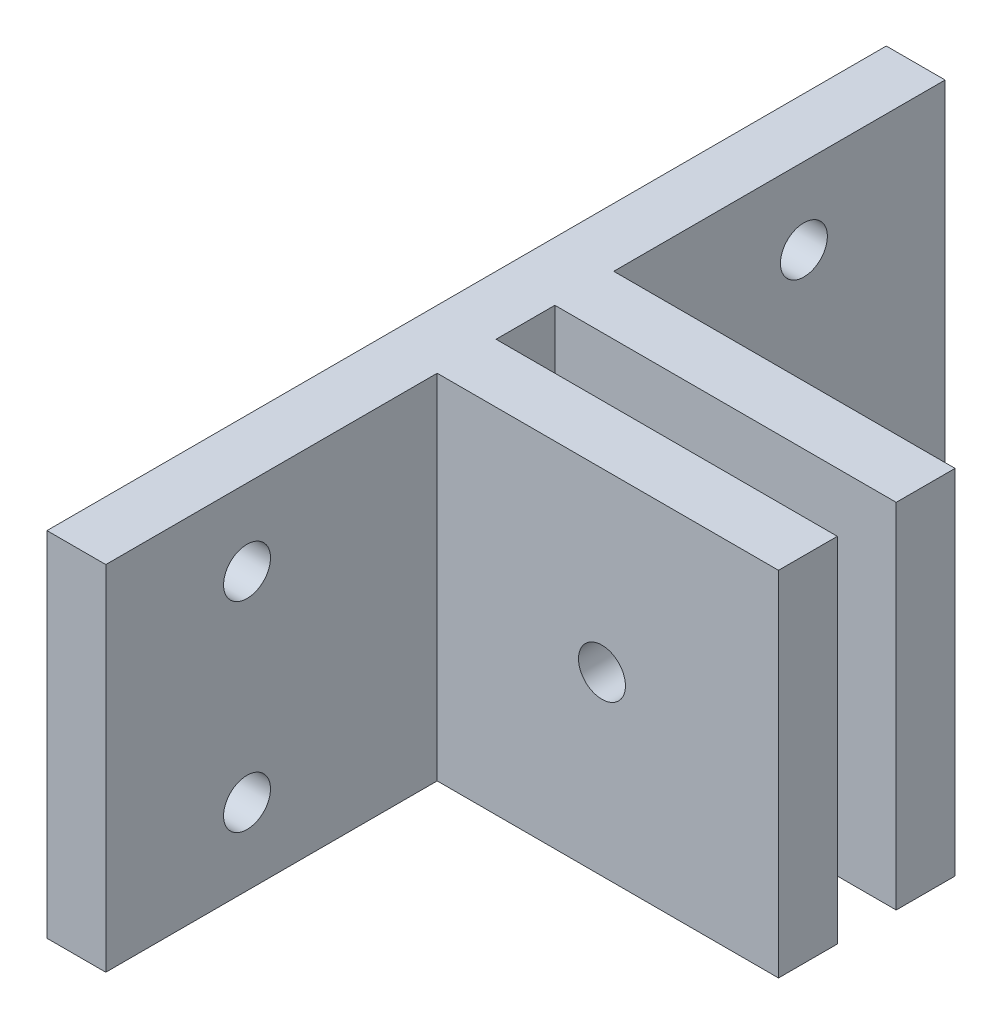
ISO-10303-21;
HEADER;
FILE_DESCRIPTION(('STEP AP214'),'2;1');
FILE_NAME('part.step','',(''),(''),'','','');
FILE_SCHEMA(('AUTOMOTIVE_DESIGN { 1 0 10303 214 1 1 1 1 }'));
ENDSEC;
DATA;
#1=APPLICATION_CONTEXT('core data for automotive mechanical design processes');
#2=APPLICATION_PROTOCOL_DEFINITION('international standard','automotive_design',2000,#1);
#3=PRODUCT_CONTEXT('',#1,'mechanical');
#4=PRODUCT('Part','Part','',(#3));
#5=PRODUCT_RELATED_PRODUCT_CATEGORY('part','',(#4));
#6=PRODUCT_DEFINITION_FORMATION('','',#4);
#7=PRODUCT_DEFINITION_CONTEXT('part definition',#1,'design');
#8=PRODUCT_DEFINITION('design','',#6,#7);
#9=PRODUCT_DEFINITION_SHAPE('','',#8);
#10=(LENGTH_UNIT() NAMED_UNIT(*) SI_UNIT(.MILLI.,.METRE.));
#11=(NAMED_UNIT(*) PLANE_ANGLE_UNIT() SI_UNIT($,.RADIAN.));
#12=(NAMED_UNIT(*) SI_UNIT($,.STERADIAN.) SOLID_ANGLE_UNIT());
#13=UNCERTAINTY_MEASURE_WITH_UNIT(LENGTH_MEASURE(1.E-05),#10,'distance_accuracy_value','');
#14=(GEOMETRIC_REPRESENTATION_CONTEXT(3) GLOBAL_UNCERTAINTY_ASSIGNED_CONTEXT((#13)) GLOBAL_UNIT_ASSIGNED_CONTEXT((#10,
#11,#12)) REPRESENTATION_CONTEXT('',''));
#15=CARTESIAN_POINT('',(0.,0.,0.));
#16=DIRECTION('',(0.,0.,1.));
#17=DIRECTION('',(1.,0.,0.));
#18=AXIS2_PLACEMENT_3D('',#15,#16,#17);
#19=CARTESIAN_POINT('',(0.,19.05,-22.6419411646515));
#20=DIRECTION('',(0.,0.,1.));
#21=DIRECTION('',(1.,0.,0.));
#22=AXIS2_PLACEMENT_3D('',#19,#20,#21);
#23=PLANE('',#22);
#24=DIRECTION('',(-1.,0.,0.));
#25=VECTOR('',#24,1.);
#26=CARTESIAN_POINT('',(0.,0.,-22.6419411646515));
#27=LINE('',#26,#25);
#28=CARTESIAN_POINT('',(3.175,0.,-22.6419411646515));
#29=VERTEX_POINT('',#28);
#30=CARTESIAN_POINT('',(0.,0.,-22.6419411646515));
#31=VERTEX_POINT('',#30);
#32=EDGE_CURVE('E156',#29,#31,#27,.T.);
#33=ORIENTED_EDGE('',*,*,#32,.T.);
#34=DIRECTION('',(0.,-1.,0.));
#35=VECTOR('',#34,1.);
#36=CARTESIAN_POINT('',(0.,19.05,-22.6419411646515));
#37=LINE('',#36,#35);
#38=CARTESIAN_POINT('',(0.,19.05,-22.6419411646515));
#39=VERTEX_POINT('',#38);
#40=EDGE_CURVE('E11',#39,#31,#37,.T.);
#41=ORIENTED_EDGE('',*,*,#40,.F.);
#42=DIRECTION('',(-1.,0.,0.));
#43=VECTOR('',#42,1.);
#44=CARTESIAN_POINT('',(0.,19.05,-22.6419411646515));
#45=LINE('',#44,#43);
#46=CARTESIAN_POINT('',(3.175,19.05,-22.6419411646515));
#47=VERTEX_POINT('',#46);
#48=EDGE_CURVE('E179',#47,#39,#45,.T.);
#49=ORIENTED_EDGE('',*,*,#48,.F.);
#50=DIRECTION('',(0.,-1.,0.));
#51=VECTOR('',#50,1.);
#52=CARTESIAN_POINT('',(3.175,19.05,-22.6419411646515));
#53=LINE('',#52,#51);
#54=EDGE_CURVE('E152',#47,#29,#53,.T.);
#55=ORIENTED_EDGE('',*,*,#54,.T.);
#56=EDGE_LOOP('',(#33,#41,#49,#55));
#57=FACE_BOUND('',#56,.T.);
#58=ADVANCED_FACE('F35',(#57),#23,.F.);
#59=CARTESIAN_POINT('',(0.,19.05,22.6419411646515));
#60=DIRECTION('',(1.,0.,0.));
#61=DIRECTION('',(0.,0.,-1.));
#62=AXIS2_PLACEMENT_3D('',#59,#60,#61);
#63=PLANE('',#62);
#64=CARTESIAN_POINT('',(0.,14.9225,-15.0219411646515));
#65=DIRECTION('',(1.,0.,0.));
#66=DIRECTION('',(0.,0.,1.));
#67=AXIS2_PLACEMENT_3D('',#64,#65,#66);
#68=CIRCLE('',#67,1.26619);
#69=CARTESIAN_POINT('',(0.,14.9225,-13.7557511646515));
#70=VERTEX_POINT('',#69);
#71=EDGE_CURVE('E449',#70,#70,#68,.T.);
#72=ORIENTED_EDGE('',*,*,#71,.T.);
#73=EDGE_LOOP('',(#72));
#74=FACE_BOUND('',#73,.T.);
#75=CARTESIAN_POINT('',(0.,4.1275,-15.0219411646515));
#76=DIRECTION('',(1.,0.,0.));
#77=DIRECTION('',(0.,0.,-1.));
#78=AXIS2_PLACEMENT_3D('',#75,#76,#77);
#79=CIRCLE('',#78,1.26619);
#80=CARTESIAN_POINT('',(0.,4.1275,-16.2881311646515));
#81=VERTEX_POINT('',#80);
#82=EDGE_CURVE('E439',#81,#81,#79,.T.);
#83=ORIENTED_EDGE('',*,*,#82,.T.);
#84=EDGE_LOOP('',(#83));
#85=FACE_BOUND('',#84,.T.);
#86=CARTESIAN_POINT('',(0.,4.1275,15.0219411646515));
#87=DIRECTION('',(1.,0.,0.));
#88=DIRECTION('',(0.,0.,1.));
#89=AXIS2_PLACEMENT_3D('',#86,#87,#88);
#90=CIRCLE('',#89,1.26619);
#91=CARTESIAN_POINT('',(0.,4.1275,16.2881311646515));
#92=VERTEX_POINT('',#91);
#93=EDGE_CURVE('E435',#92,#92,#90,.T.);
#94=ORIENTED_EDGE('',*,*,#93,.T.);
#95=EDGE_LOOP('',(#94));
#96=FACE_BOUND('',#95,.T.);
#97=CARTESIAN_POINT('',(0.,14.9225,15.0219411646515));
#98=DIRECTION('',(1.,0.,0.));
#99=DIRECTION('',(0.,0.,-1.));
#100=AXIS2_PLACEMENT_3D('',#97,#98,#99);
#101=CIRCLE('',#100,1.26619);
#102=CARTESIAN_POINT('',(0.,14.9225,13.7557511646515));
#103=VERTEX_POINT('',#102);
#104=EDGE_CURVE('E454',#103,#103,#101,.T.);
#105=ORIENTED_EDGE('',*,*,#104,.T.);
#106=EDGE_LOOP('',(#105));
#107=FACE_BOUND('',#106,.T.);
#108=DIRECTION('',(0.,0.,1.));
#109=VECTOR('',#108,1.);
#110=CARTESIAN_POINT('',(0.,0.,22.6419411646515));
#111=LINE('',#110,#109);
#112=CARTESIAN_POINT('',(0.,0.,22.6419411646515));
#113=VERTEX_POINT('',#112);
#114=EDGE_CURVE('E159',#31,#113,#111,.T.);
#115=ORIENTED_EDGE('',*,*,#114,.T.);
#116=DIRECTION('',(0.,-1.,0.));
#117=VECTOR('',#116,1.);
#118=CARTESIAN_POINT('',(0.,19.05,22.6419411646515));
#119=LINE('',#118,#117);
#120=CARTESIAN_POINT('',(0.,19.05,22.6419411646515));
#121=VERTEX_POINT('',#120);
#122=EDGE_CURVE('E44',#121,#113,#119,.T.);
#123=ORIENTED_EDGE('',*,*,#122,.F.);
#124=DIRECTION('',(0.,0.,1.));
#125=VECTOR('',#124,1.);
#126=CARTESIAN_POINT('',(0.,19.05,22.6419411646515));
#127=LINE('',#126,#125);
#128=EDGE_CURVE('E107',#39,#121,#127,.T.);
#129=ORIENTED_EDGE('',*,*,#128,.F.);
#130=ORIENTED_EDGE('',*,*,#40,.T.);
#131=EDGE_LOOP('',(#115,#123,#129,#130));
#132=FACE_BOUND('',#131,.T.);
#133=ADVANCED_FACE('F262',(#74,#85,#96,#107,#132),#63,.F.);
#134=CARTESIAN_POINT('',(0.,19.05,22.6419411646515));
#135=DIRECTION('',(0.,0.,-1.));
#136=DIRECTION('',(-1.,0.,0.));
#137=AXIS2_PLACEMENT_3D('',#134,#135,#136);
#138=PLANE('',#137);
#139=DIRECTION('',(1.,0.,0.));
#140=VECTOR('',#139,1.);
#141=CARTESIAN_POINT('',(0.,0.,22.6419411646515));
#142=LINE('',#141,#140);
#143=CARTESIAN_POINT('',(3.175,0.,22.6419411646515));
#144=VERTEX_POINT('',#143);
#145=EDGE_CURVE('E162',#113,#144,#142,.T.);
#146=ORIENTED_EDGE('',*,*,#145,.T.);
#147=DIRECTION('',(0.,-1.,0.));
#148=VECTOR('',#147,1.);
#149=CARTESIAN_POINT('',(3.175,19.05,22.6419411646515));
#150=LINE('',#149,#148);
#151=CARTESIAN_POINT('',(3.175,19.05,22.6419411646515));
#152=VERTEX_POINT('',#151);
#153=EDGE_CURVE('E198',#152,#144,#150,.T.);
#154=ORIENTED_EDGE('',*,*,#153,.F.);
#155=DIRECTION('',(1.,0.,0.));
#156=VECTOR('',#155,1.);
#157=CARTESIAN_POINT('',(0.,19.05,22.6419411646515));
#158=LINE('',#157,#156);
#159=EDGE_CURVE('E207',#121,#152,#158,.T.);
#160=ORIENTED_EDGE('',*,*,#159,.F.);
#161=ORIENTED_EDGE('',*,*,#122,.T.);
#162=EDGE_LOOP('',(#146,#154,#160,#161));
#163=FACE_BOUND('',#162,.T.);
#164=ADVANCED_FACE('F205',(#163),#138,.F.);
#165=CARTESIAN_POINT('',(3.175,19.05,22.6419411646515));
#166=DIRECTION('',(-1.,0.,0.));
#167=DIRECTION('',(0.,0.,1.));
#168=AXIS2_PLACEMENT_3D('',#165,#166,#167);
#169=PLANE('',#168);
#170=CARTESIAN_POINT('',(3.175,4.1275,15.0219411646515));
#171=DIRECTION('',(1.,0.,0.));
#172=DIRECTION('',(0.,0.,1.));
#173=AXIS2_PLACEMENT_3D('',#170,#171,#172);
#174=CIRCLE('',#173,1.26619);
#175=CARTESIAN_POINT('',(3.175,4.1275,16.2881311646515));
#176=VERTEX_POINT('',#175);
#177=EDGE_CURVE('E438',#176,#176,#174,.T.);
#178=ORIENTED_EDGE('',*,*,#177,.F.);
#179=EDGE_LOOP('',(#178));
#180=FACE_BOUND('',#179,.T.);
#181=CARTESIAN_POINT('',(3.175,14.9225,15.0219411646515));
#182=DIRECTION('',(1.,0.,0.));
#183=DIRECTION('',(0.,0.,-1.));
#184=AXIS2_PLACEMENT_3D('',#181,#182,#183);
#185=CIRCLE('',#184,1.26619);
#186=CARTESIAN_POINT('',(3.175,14.9225,13.7557511646515));
#187=VERTEX_POINT('',#186);
#188=EDGE_CURVE('E441',#187,#187,#185,.T.);
#189=ORIENTED_EDGE('',*,*,#188,.F.);
#190=EDGE_LOOP('',(#189));
#191=FACE_BOUND('',#190,.T.);
#192=DIRECTION('',(0.,0.,-1.));
#193=VECTOR('',#192,1.);
#194=CARTESIAN_POINT('',(3.175,0.,22.6419411646515));
#195=LINE('',#194,#193);
#196=CARTESIAN_POINT('',(3.175,0.,4.7625));
#197=VERTEX_POINT('',#196);
#198=EDGE_CURVE('E164',#144,#197,#195,.T.);
#199=ORIENTED_EDGE('',*,*,#198,.T.);
#200=DIRECTION('',(0.,-1.,0.));
#201=VECTOR('',#200,1.);
#202=CARTESIAN_POINT('',(3.175,19.05,4.7625));
#203=LINE('',#202,#201);
#204=CARTESIAN_POINT('',(3.175,19.05,4.7625));
#205=VERTEX_POINT('',#204);
#206=EDGE_CURVE('E195',#205,#197,#203,.T.);
#207=ORIENTED_EDGE('',*,*,#206,.F.);
#208=DIRECTION('',(0.,0.,-1.));
#209=VECTOR('',#208,1.);
#210=CARTESIAN_POINT('',(3.175,19.05,22.6419411646515));
#211=LINE('',#210,#209);
#212=EDGE_CURVE('E225',#152,#205,#211,.T.);
#213=ORIENTED_EDGE('',*,*,#212,.F.);
#214=ORIENTED_EDGE('',*,*,#153,.T.);
#215=EDGE_LOOP('',(#199,#207,#213,#214));
#216=FACE_BOUND('',#215,.T.);
#217=ADVANCED_FACE('F216',(#180,#191,#216),#169,.F.);
#218=CARTESIAN_POINT('',(3.175,19.05,4.7625));
#219=DIRECTION('',(0.,0.,-1.));
#220=DIRECTION('',(-1.,0.,0.));
#221=AXIS2_PLACEMENT_3D('',#218,#219,#220);
#222=PLANE('',#221);
#223=CARTESIAN_POINT('',(12.065,9.525,4.7625));
#224=DIRECTION('',(0.,0.,-1.));
#225=DIRECTION('',(-1.,0.,0.));
#226=AXIS2_PLACEMENT_3D('',#223,#224,#225);
#227=CIRCLE('',#226,1.26619);
#228=CARTESIAN_POINT('',(10.79881,9.525,4.7625));
#229=VERTEX_POINT('',#228);
#230=EDGE_CURVE('E160',#229,#229,#227,.T.);
#231=ORIENTED_EDGE('',*,*,#230,.T.);
#232=EDGE_LOOP('',(#231));
#233=FACE_BOUND('',#232,.T.);
#234=DIRECTION('',(1.,0.,0.));
#235=VECTOR('',#234,1.);
#236=CARTESIAN_POINT('',(3.175,0.,4.7625));
#237=LINE('',#236,#235);
#238=CARTESIAN_POINT('',(21.59,0.,4.7625));
#239=VERTEX_POINT('',#238);
#240=EDGE_CURVE('E166',#197,#239,#237,.T.);
#241=ORIENTED_EDGE('',*,*,#240,.T.);
#242=DIRECTION('',(0.,-1.,0.));
#243=VECTOR('',#242,1.);
#244=CARTESIAN_POINT('',(21.59,19.05,4.7625));
#245=LINE('',#244,#243);
#246=CARTESIAN_POINT('',(21.59,19.05,4.7625));
#247=VERTEX_POINT('',#246);
#248=EDGE_CURVE('E192',#247,#239,#245,.T.);
#249=ORIENTED_EDGE('',*,*,#248,.F.);
#250=DIRECTION('',(1.,0.,0.));
#251=VECTOR('',#250,1.);
#252=CARTESIAN_POINT('',(3.175,19.05,4.7625));
#253=LINE('',#252,#251);
#254=EDGE_CURVE('E222',#205,#247,#253,.T.);
#255=ORIENTED_EDGE('',*,*,#254,.F.);
#256=ORIENTED_EDGE('',*,*,#206,.T.);
#257=EDGE_LOOP('',(#241,#249,#255,#256));
#258=FACE_BOUND('',#257,.T.);
#259=ADVANCED_FACE('F220',(#233,#258),#222,.F.);
#260=CARTESIAN_POINT('',(21.59,19.05,4.7625));
#261=DIRECTION('',(-1.,0.,0.));
#262=DIRECTION('',(0.,0.,1.));
#263=AXIS2_PLACEMENT_3D('',#260,#261,#262);
#264=PLANE('',#263);
#265=DIRECTION('',(0.,0.,-1.));
#266=VECTOR('',#265,1.);
#267=CARTESIAN_POINT('',(21.59,0.,4.7625));
#268=LINE('',#267,#266);
#269=CARTESIAN_POINT('',(21.59,0.,1.5875));
#270=VERTEX_POINT('',#269);
#271=EDGE_CURVE('E168',#239,#270,#268,.T.);
#272=ORIENTED_EDGE('',*,*,#271,.T.);
#273=DIRECTION('',(0.,-1.,0.));
#274=VECTOR('',#273,1.);
#275=CARTESIAN_POINT('',(21.59,19.05,1.5875));
#276=LINE('',#275,#274);
#277=CARTESIAN_POINT('',(21.59,19.05,1.5875));
#278=VERTEX_POINT('',#277);
#279=EDGE_CURVE('E189',#278,#270,#276,.T.);
#280=ORIENTED_EDGE('',*,*,#279,.F.);
#281=DIRECTION('',(0.,0.,-1.));
#282=VECTOR('',#281,1.);
#283=CARTESIAN_POINT('',(21.59,19.05,4.7625));
#284=LINE('',#283,#282);
#285=EDGE_CURVE('E224',#247,#278,#284,.T.);
#286=ORIENTED_EDGE('',*,*,#285,.F.);
#287=ORIENTED_EDGE('',*,*,#248,.T.);
#288=EDGE_LOOP('',(#272,#280,#286,#287));
#289=FACE_BOUND('',#288,.T.);
#290=ADVANCED_FACE('F279',(#289),#264,.F.);
#291=CARTESIAN_POINT('',(21.59,19.05,1.5875));
#292=DIRECTION('',(0.,0.,1.));
#293=DIRECTION('',(1.,0.,0.));
#294=AXIS2_PLACEMENT_3D('',#291,#292,#293);
#295=PLANE('',#294);
#296=CARTESIAN_POINT('',(12.065,9.525,1.5875));
#297=DIRECTION('',(0.,0.,1.));
#298=DIRECTION('',(1.,0.,0.));
#299=AXIS2_PLACEMENT_3D('',#296,#297,#298);
#300=CIRCLE('',#299,1.26619);
#301=CARTESIAN_POINT('',(13.33119,9.525,1.5875));
#302=VERTEX_POINT('',#301);
#303=EDGE_CURVE('E462',#302,#302,#300,.T.);
#304=ORIENTED_EDGE('',*,*,#303,.T.);
#305=EDGE_LOOP('',(#304));
#306=FACE_BOUND('',#305,.T.);
#307=DIRECTION('',(-1.,0.,0.));
#308=VECTOR('',#307,1.);
#309=CARTESIAN_POINT('',(21.59,0.,1.5875));
#310=LINE('',#309,#308);
#311=CARTESIAN_POINT('',(3.175,0.,1.5875));
#312=VERTEX_POINT('',#311);
#313=EDGE_CURVE('E170',#270,#312,#310,.T.);
#314=ORIENTED_EDGE('',*,*,#313,.T.);
#315=DIRECTION('',(0.,-1.,0.));
#316=VECTOR('',#315,1.);
#317=CARTESIAN_POINT('',(3.175,19.05,1.5875));
#318=LINE('',#317,#316);
#319=CARTESIAN_POINT('',(3.175,19.05,1.5875));
#320=VERTEX_POINT('',#319);
#321=EDGE_CURVE('E186',#320,#312,#318,.T.);
#322=ORIENTED_EDGE('',*,*,#321,.F.);
#323=DIRECTION('',(-1.,0.,0.));
#324=VECTOR('',#323,1.);
#325=CARTESIAN_POINT('',(21.59,19.05,1.5875));
#326=LINE('',#325,#324);
#327=EDGE_CURVE('E227',#278,#320,#326,.T.);
#328=ORIENTED_EDGE('',*,*,#327,.F.);
#329=ORIENTED_EDGE('',*,*,#279,.T.);
#330=EDGE_LOOP('',(#314,#322,#328,#329));
#331=FACE_BOUND('',#330,.T.);
#332=ADVANCED_FACE('F283',(#306,#331),#295,.F.);
#333=CARTESIAN_POINT('',(3.175,19.05,-1.5875));
#334=DIRECTION('',(-1.,0.,0.));
#335=DIRECTION('',(0.,0.,1.));
#336=AXIS2_PLACEMENT_3D('',#333,#334,#335);
#337=PLANE('',#336);
#338=DIRECTION('',(0.,0.,-1.));
#339=VECTOR('',#338,1.);
#340=CARTESIAN_POINT('',(3.175,0.,-1.5875));
#341=LINE('',#340,#339);
#342=CARTESIAN_POINT('',(3.175,0.,-1.5875));
#343=VERTEX_POINT('',#342);
#344=EDGE_CURVE('E172',#312,#343,#341,.T.);
#345=ORIENTED_EDGE('',*,*,#344,.T.);
#346=DIRECTION('',(0.,-1.,0.));
#347=VECTOR('',#346,1.);
#348=CARTESIAN_POINT('',(3.175,19.05,-1.5875));
#349=LINE('',#348,#347);
#350=CARTESIAN_POINT('',(3.175,19.05,-1.5875));
#351=VERTEX_POINT('',#350);
#352=EDGE_CURVE('E183',#351,#343,#349,.T.);
#353=ORIENTED_EDGE('',*,*,#352,.F.);
#354=DIRECTION('',(0.,0.,-1.));
#355=VECTOR('',#354,1.);
#356=CARTESIAN_POINT('',(3.175,19.05,-1.5875));
#357=LINE('',#356,#355);
#358=EDGE_CURVE('E233',#320,#351,#357,.T.);
#359=ORIENTED_EDGE('',*,*,#358,.F.);
#360=ORIENTED_EDGE('',*,*,#321,.T.);
#361=EDGE_LOOP('',(#345,#353,#359,#360));
#362=FACE_BOUND('',#361,.T.);
#363=ADVANCED_FACE('F239',(#362),#337,.F.);
#364=CARTESIAN_POINT('',(21.59,19.05,-1.5875));
#365=DIRECTION('',(0.,0.,-1.));
#366=DIRECTION('',(-1.,0.,0.));
#367=AXIS2_PLACEMENT_3D('',#364,#365,#366);
#368=PLANE('',#367);
#369=CARTESIAN_POINT('',(12.065,9.525,-1.5875));
#370=DIRECTION('',(0.,0.,-1.));
#371=DIRECTION('',(-1.,0.,0.));
#372=AXIS2_PLACEMENT_3D('',#369,#370,#371);
#373=CIRCLE('',#372,1.26619);
#374=CARTESIAN_POINT('',(10.79881,9.525,-1.5875));
#375=VERTEX_POINT('',#374);
#376=EDGE_CURVE('E459',#375,#375,#373,.T.);
#377=ORIENTED_EDGE('',*,*,#376,.T.);
#378=EDGE_LOOP('',(#377));
#379=FACE_BOUND('',#378,.T.);
#380=DIRECTION('',(1.,0.,0.));
#381=VECTOR('',#380,1.);
#382=CARTESIAN_POINT('',(21.59,0.,-1.5875));
#383=LINE('',#382,#381);
#384=CARTESIAN_POINT('',(21.59,0.,-1.5875));
#385=VERTEX_POINT('',#384);
#386=EDGE_CURVE('E174',#343,#385,#383,.T.);
#387=ORIENTED_EDGE('',*,*,#386,.T.);
#388=DIRECTION('',(0.,-1.,0.));
#389=VECTOR('',#388,1.);
#390=CARTESIAN_POINT('',(21.59,19.05,-1.5875));
#391=LINE('',#390,#389);
#392=CARTESIAN_POINT('',(21.59,19.05,-1.5875));
#393=VERTEX_POINT('',#392);
#394=EDGE_CURVE('E147',#393,#385,#391,.T.);
#395=ORIENTED_EDGE('',*,*,#394,.F.);
#396=DIRECTION('',(1.,0.,0.));
#397=VECTOR('',#396,1.);
#398=CARTESIAN_POINT('',(21.59,19.05,-1.5875));
#399=LINE('',#398,#397);
#400=EDGE_CURVE('E138',#351,#393,#399,.T.);
#401=ORIENTED_EDGE('',*,*,#400,.F.);
#402=ORIENTED_EDGE('',*,*,#352,.T.);
#403=EDGE_LOOP('',(#387,#395,#401,#402));
#404=FACE_BOUND('',#403,.T.);
#405=ADVANCED_FACE('F243',(#379,#404),#368,.F.);
#406=CARTESIAN_POINT('',(21.59,19.05,-4.7625));
#407=DIRECTION('',(-1.,0.,0.));
#408=DIRECTION('',(0.,0.,1.));
#409=AXIS2_PLACEMENT_3D('',#406,#407,#408);
#410=PLANE('',#409);
#411=DIRECTION('',(0.,0.,-1.));
#412=VECTOR('',#411,1.);
#413=CARTESIAN_POINT('',(21.59,0.,-4.7625));
#414=LINE('',#413,#412);
#415=CARTESIAN_POINT('',(21.59,0.,-4.7625));
#416=VERTEX_POINT('',#415);
#417=EDGE_CURVE('E146',#385,#416,#414,.T.);
#418=ORIENTED_EDGE('',*,*,#417,.T.);
#419=DIRECTION('',(0.,-1.,0.));
#420=VECTOR('',#419,1.);
#421=CARTESIAN_POINT('',(21.59,19.05,-4.7625));
#422=LINE('',#421,#420);
#423=CARTESIAN_POINT('',(21.59,19.05,-4.7625));
#424=VERTEX_POINT('',#423);
#425=EDGE_CURVE('E143',#424,#416,#422,.T.);
#426=ORIENTED_EDGE('',*,*,#425,.F.);
#427=DIRECTION('',(0.,0.,-1.));
#428=VECTOR('',#427,1.);
#429=CARTESIAN_POINT('',(21.59,19.05,-4.7625));
#430=LINE('',#429,#428);
#431=EDGE_CURVE('E132',#393,#424,#430,.T.);
#432=ORIENTED_EDGE('',*,*,#431,.F.);
#433=ORIENTED_EDGE('',*,*,#394,.T.);
#434=EDGE_LOOP('',(#418,#426,#432,#433));
#435=FACE_BOUND('',#434,.T.);
#436=ADVANCED_FACE('F144',(#435),#410,.F.);
#437=CARTESIAN_POINT('',(3.175,19.05,-4.7625));
#438=DIRECTION('',(0.,0.,1.));
#439=DIRECTION('',(1.,0.,0.));
#440=AXIS2_PLACEMENT_3D('',#437,#438,#439);
#441=PLANE('',#440);
#442=CARTESIAN_POINT('',(12.065,9.525,-4.7625));
#443=DIRECTION('',(0.,0.,1.));
#444=DIRECTION('',(1.,0.,0.));
#445=AXIS2_PLACEMENT_3D('',#442,#443,#444);
#446=CIRCLE('',#445,1.26619);
#447=CARTESIAN_POINT('',(13.33119,9.525,-4.7625));
#448=VERTEX_POINT('',#447);
#449=EDGE_CURVE('E38',#448,#448,#446,.T.);
#450=ORIENTED_EDGE('',*,*,#449,.T.);
#451=EDGE_LOOP('',(#450));
#452=FACE_BOUND('',#451,.T.);
#453=DIRECTION('',(-1.,0.,0.));
#454=VECTOR('',#453,1.);
#455=CARTESIAN_POINT('',(3.175,0.,-4.7625));
#456=LINE('',#455,#454);
#457=CARTESIAN_POINT('',(3.175,0.,-4.7625));
#458=VERTEX_POINT('',#457);
#459=EDGE_CURVE('E93',#416,#458,#456,.T.);
#460=ORIENTED_EDGE('',*,*,#459,.T.);
#461=DIRECTION('',(0.,-1.,0.));
#462=VECTOR('',#461,1.);
#463=CARTESIAN_POINT('',(3.175,19.05,-4.7625));
#464=LINE('',#463,#462);
#465=CARTESIAN_POINT('',(3.175,19.05,-4.7625));
#466=VERTEX_POINT('',#465);
#467=EDGE_CURVE('E148',#466,#458,#464,.T.);
#468=ORIENTED_EDGE('',*,*,#467,.F.);
#469=DIRECTION('',(-1.,0.,0.));
#470=VECTOR('',#469,1.);
#471=CARTESIAN_POINT('',(3.175,19.05,-4.7625));
#472=LINE('',#471,#470);
#473=EDGE_CURVE('E136',#424,#466,#472,.T.);
#474=ORIENTED_EDGE('',*,*,#473,.F.);
#475=ORIENTED_EDGE('',*,*,#425,.T.);
#476=EDGE_LOOP('',(#460,#468,#474,#475));
#477=FACE_BOUND('',#476,.T.);
#478=ADVANCED_FACE('F150',(#452,#477),#441,.F.);
#479=CARTESIAN_POINT('',(3.175,19.05,-22.6419411646515));
#480=DIRECTION('',(-1.,0.,0.));
#481=DIRECTION('',(0.,0.,1.));
#482=AXIS2_PLACEMENT_3D('',#479,#480,#481);
#483=PLANE('',#482);
#484=CARTESIAN_POINT('',(3.17499999999999,14.9225,-15.0219411646515));
#485=DIRECTION('',(1.,0.,0.));
#486=DIRECTION('',(0.,0.,1.));
#487=AXIS2_PLACEMENT_3D('',#484,#485,#486);
#488=CIRCLE('',#487,1.26619);
#489=CARTESIAN_POINT('',(3.17499999999999,14.9225,-13.7557511646515));
#490=VERTEX_POINT('',#489);
#491=EDGE_CURVE('E451',#490,#490,#488,.T.);
#492=ORIENTED_EDGE('',*,*,#491,.F.);
#493=EDGE_LOOP('',(#492));
#494=FACE_BOUND('',#493,.T.);
#495=CARTESIAN_POINT('',(3.17499999999999,4.1275,-15.0219411646515));
#496=DIRECTION('',(1.,0.,0.));
#497=DIRECTION('',(0.,0.,-1.));
#498=AXIS2_PLACEMENT_3D('',#495,#496,#497);
#499=CIRCLE('',#498,1.26619);
#500=CARTESIAN_POINT('',(3.17499999999999,4.1275,-16.2881311646515));
#501=VERTEX_POINT('',#500);
#502=EDGE_CURVE('E444',#501,#501,#499,.T.);
#503=ORIENTED_EDGE('',*,*,#502,.F.);
#504=EDGE_LOOP('',(#503));
#505=FACE_BOUND('',#504,.T.);
#506=DIRECTION('',(0.,0.,-1.));
#507=VECTOR('',#506,1.);
#508=CARTESIAN_POINT('',(3.175,0.,-22.6419411646515));
#509=LINE('',#508,#507);
#510=EDGE_CURVE('E99',#458,#29,#509,.T.);
#511=ORIENTED_EDGE('',*,*,#510,.T.);
#512=ORIENTED_EDGE('',*,*,#54,.F.);
#513=DIRECTION('',(0.,0.,-1.));
#514=VECTOR('',#513,1.);
#515=CARTESIAN_POINT('',(3.175,19.05,-22.6419411646515));
#516=LINE('',#515,#514);
#517=EDGE_CURVE('E52',#466,#47,#516,.T.);
#518=ORIENTED_EDGE('',*,*,#517,.F.);
#519=ORIENTED_EDGE('',*,*,#467,.T.);
#520=EDGE_LOOP('',(#511,#512,#518,#519));
#521=FACE_BOUND('',#520,.T.);
#522=ADVANCED_FACE('F247',(#494,#505,#521),#483,.F.);
#523=CARTESIAN_POINT('',(0.,19.05,0.));
#524=DIRECTION('',(0.,-1.,0.));
#525=DIRECTION('',(0.,0.,-1.));
#526=AXIS2_PLACEMENT_3D('',#523,#524,#525);
#527=PLANE('',#526);
#528=ORIENTED_EDGE('',*,*,#48,.T.);
#529=ORIENTED_EDGE('',*,*,#128,.T.);
#530=ORIENTED_EDGE('',*,*,#159,.T.);
#531=ORIENTED_EDGE('',*,*,#212,.T.);
#532=ORIENTED_EDGE('',*,*,#254,.T.);
#533=ORIENTED_EDGE('',*,*,#285,.T.);
#534=ORIENTED_EDGE('',*,*,#327,.T.);
#535=ORIENTED_EDGE('',*,*,#358,.T.);
#536=ORIENTED_EDGE('',*,*,#400,.T.);
#537=ORIENTED_EDGE('',*,*,#431,.T.);
#538=ORIENTED_EDGE('',*,*,#473,.T.);
#539=ORIENTED_EDGE('',*,*,#517,.T.);
#540=EDGE_LOOP('',(#528,#529,#530,#531,#532,#533,#534,#535,#536,#537,#538,#539));
#541=FACE_BOUND('',#540,.T.);
#542=ADVANCED_FACE('F134',(#541),#527,.F.);
#543=CARTESIAN_POINT('',(0.,0.,0.));
#544=DIRECTION('',(0.,-1.,0.));
#545=DIRECTION('',(0.,0.,-1.));
#546=AXIS2_PLACEMENT_3D('',#543,#544,#545);
#547=PLANE('',#546);
#548=ORIENTED_EDGE('',*,*,#32,.F.);
#549=ORIENTED_EDGE('',*,*,#510,.F.);
#550=ORIENTED_EDGE('',*,*,#459,.F.);
#551=ORIENTED_EDGE('',*,*,#417,.F.);
#552=ORIENTED_EDGE('',*,*,#386,.F.);
#553=ORIENTED_EDGE('',*,*,#344,.F.);
#554=ORIENTED_EDGE('',*,*,#313,.F.);
#555=ORIENTED_EDGE('',*,*,#271,.F.);
#556=ORIENTED_EDGE('',*,*,#240,.F.);
#557=ORIENTED_EDGE('',*,*,#198,.F.);
#558=ORIENTED_EDGE('',*,*,#145,.F.);
#559=ORIENTED_EDGE('',*,*,#114,.F.);
#560=EDGE_LOOP('',(#548,#549,#550,#551,#552,#553,#554,#555,#556,#557,#558,#559));
#561=FACE_BOUND('',#560,.T.);
#562=ADVANCED_FACE('F211',(#561),#547,.T.);
#563=CARTESIAN_POINT('',(12.065,9.525,-22.6419411646515));
#564=DIRECTION('',(0.,0.,1.));
#565=DIRECTION('',(1.,0.,0.));
#566=AXIS2_PLACEMENT_3D('',#563,#564,#565);
#567=CYLINDRICAL_SURFACE('',#566,1.26619);
#568=ORIENTED_EDGE('',*,*,#449,.F.);
#569=EDGE_LOOP('',(#568));
#570=FACE_BOUND('',#569,.T.);
#571=ORIENTED_EDGE('',*,*,#376,.F.);
#572=EDGE_LOOP('',(#571));
#573=FACE_BOUND('',#572,.T.);
#574=ADVANCED_FACE('F313',(#570,#573),#567,.F.);
#575=ORIENTED_EDGE('',*,*,#303,.F.);
#576=EDGE_LOOP('',(#575));
#577=FACE_BOUND('',#576,.T.);
#578=ORIENTED_EDGE('',*,*,#230,.F.);
#579=EDGE_LOOP('',(#578));
#580=FACE_BOUND('',#579,.T.);
#581=ADVANCED_FACE('F318',(#577,#580),#567,.F.);
#582=CARTESIAN_POINT('',(0.,4.1275,-15.0219411646515));
#583=DIRECTION('',(1.,0.,0.));
#584=DIRECTION('',(0.,0.,-1.));
#585=AXIS2_PLACEMENT_3D('',#582,#583,#584);
#586=CYLINDRICAL_SURFACE('',#585,1.26619);
#587=ORIENTED_EDGE('',*,*,#82,.F.);
#588=EDGE_LOOP('',(#587));
#589=FACE_BOUND('',#588,.T.);
#590=ORIENTED_EDGE('',*,*,#502,.T.);
#591=EDGE_LOOP('',(#590));
#592=FACE_BOUND('',#591,.T.);
#593=ADVANCED_FACE('F329',(#589,#592),#586,.F.);
#594=CARTESIAN_POINT('',(0.,14.9225,-15.0219411646515));
#595=DIRECTION('',(1.,0.,0.));
#596=DIRECTION('',(0.,0.,-1.));
#597=AXIS2_PLACEMENT_3D('',#594,#595,#596);
#598=CYLINDRICAL_SURFACE('',#597,1.26619);
#599=ORIENTED_EDGE('',*,*,#71,.F.);
#600=EDGE_LOOP('',(#599));
#601=FACE_BOUND('',#600,.T.);
#602=ORIENTED_EDGE('',*,*,#491,.T.);
#603=EDGE_LOOP('',(#602));
#604=FACE_BOUND('',#603,.T.);
#605=ADVANCED_FACE('F356',(#601,#604),#598,.F.);
#606=CARTESIAN_POINT('',(0.,14.9225,15.0219411646515));
#607=DIRECTION('',(1.,0.,0.));
#608=DIRECTION('',(0.,0.,-1.));
#609=AXIS2_PLACEMENT_3D('',#606,#607,#608);
#610=CYLINDRICAL_SURFACE('',#609,1.26619);
#611=ORIENTED_EDGE('',*,*,#104,.F.);
#612=EDGE_LOOP('',(#611));
#613=FACE_BOUND('',#612,.T.);
#614=ORIENTED_EDGE('',*,*,#188,.T.);
#615=EDGE_LOOP('',(#614));
#616=FACE_BOUND('',#615,.T.);
#617=ADVANCED_FACE('F366',(#613,#616),#610,.F.);
#618=CARTESIAN_POINT('',(0.,4.1275,15.0219411646515));
#619=DIRECTION('',(1.,0.,0.));
#620=DIRECTION('',(0.,0.,-1.));
#621=AXIS2_PLACEMENT_3D('',#618,#619,#620);
#622=CYLINDRICAL_SURFACE('',#621,1.26619);
#623=ORIENTED_EDGE('',*,*,#93,.F.);
#624=EDGE_LOOP('',(#623));
#625=FACE_BOUND('',#624,.T.);
#626=ORIENTED_EDGE('',*,*,#177,.T.);
#627=EDGE_LOOP('',(#626));
#628=FACE_BOUND('',#627,.T.);
#629=ADVANCED_FACE('F376',(#625,#628),#622,.F.);
#630=CLOSED_SHELL('',(#58,#133,#164,#217,#259,#290,#332,#363,#405,#436,#478,#522,#542,#562,#574,
#581,#593,#605,#617,#629));
#631=MANIFOLD_SOLID_BREP('B2',#630);
#632=ADVANCED_BREP_SHAPE_REPRESENTATION('',(#18,#631),#14);
#633=SHAPE_DEFINITION_REPRESENTATION(#9,#632);
ENDSEC;
END-ISO-10303-21;
